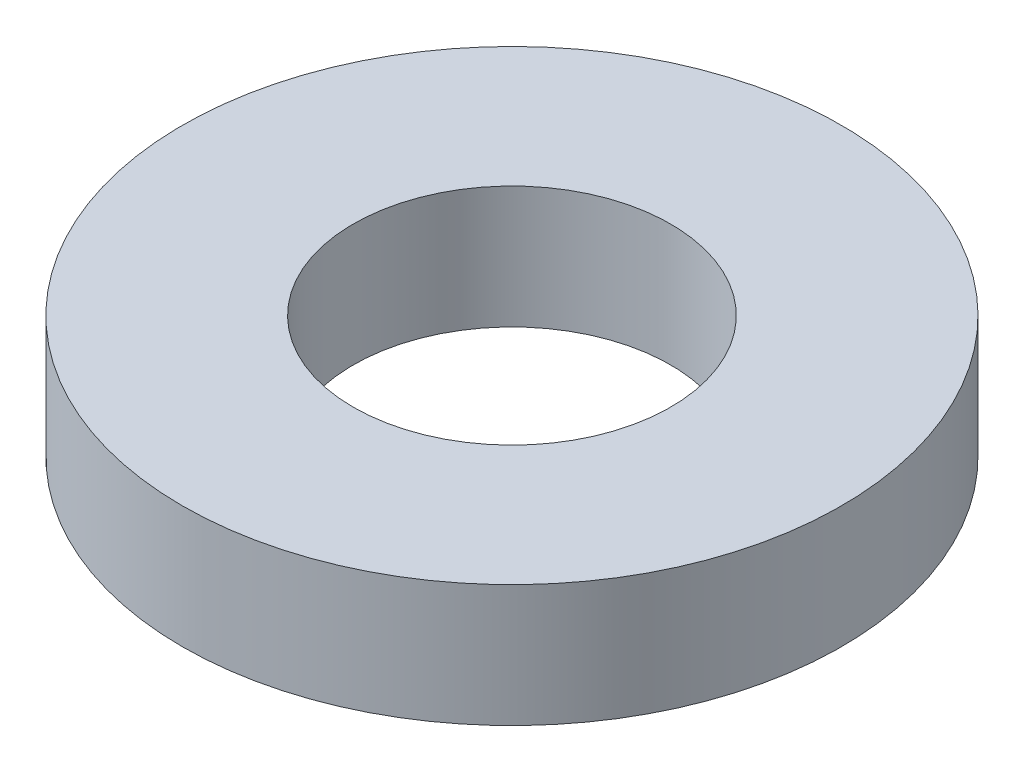
ISO-10303-21;
HEADER;
FILE_DESCRIPTION(('STEP AP214'),'2;1');
FILE_NAME('part.step','',(''),(''),'','','');
FILE_SCHEMA(('AUTOMOTIVE_DESIGN { 1 0 10303 214 1 1 1 1 }'));
ENDSEC;
DATA;
#1=APPLICATION_CONTEXT('core data for automotive mechanical design processes');
#2=APPLICATION_PROTOCOL_DEFINITION('international standard','automotive_design',2000,#1);
#3=PRODUCT_CONTEXT('',#1,'mechanical');
#4=PRODUCT('Part','Part','',(#3));
#5=PRODUCT_RELATED_PRODUCT_CATEGORY('part','',(#4));
#6=PRODUCT_DEFINITION_FORMATION('','',#4);
#7=PRODUCT_DEFINITION_CONTEXT('part definition',#1,'design');
#8=PRODUCT_DEFINITION('design','',#6,#7);
#9=PRODUCT_DEFINITION_SHAPE('','',#8);
#10=(LENGTH_UNIT() NAMED_UNIT(*) SI_UNIT(.MILLI.,.METRE.));
#11=(NAMED_UNIT(*) PLANE_ANGLE_UNIT() SI_UNIT($,.RADIAN.));
#12=(NAMED_UNIT(*) SI_UNIT($,.STERADIAN.) SOLID_ANGLE_UNIT());
#13=UNCERTAINTY_MEASURE_WITH_UNIT(LENGTH_MEASURE(1.E-05),#10,'distance_accuracy_value','');
#14=(GEOMETRIC_REPRESENTATION_CONTEXT(3) GLOBAL_UNCERTAINTY_ASSIGNED_CONTEXT((#13)) GLOBAL_UNIT_ASSIGNED_CONTEXT((#10,
#11,#12)) REPRESENTATION_CONTEXT('',''));
#15=CARTESIAN_POINT('',(0.,0.,0.));
#16=DIRECTION('',(0.,0.,1.));
#17=DIRECTION('',(1.,0.,0.));
#18=AXIS2_PLACEMENT_3D('',#15,#16,#17);
#19=CARTESIAN_POINT('',(0.,25.,0.));
#20=DIRECTION('',(0.,-1.,0.));
#21=DIRECTION('',(0.,0.,-1.));
#22=AXIS2_PLACEMENT_3D('',#19,#20,#21);
#23=CYLINDRICAL_SURFACE('',#22,67.5);
#24=CARTESIAN_POINT('',(0.,25.,0.));
#25=DIRECTION('',(0.,1.,0.));
#26=DIRECTION('',(0.,0.,1.));
#27=AXIS2_PLACEMENT_3D('',#24,#25,#26);
#28=CIRCLE('',#27,67.5);
#29=CARTESIAN_POINT('',(0.,25.,67.5));
#30=VERTEX_POINT('',#29);
#31=EDGE_CURVE('E10',#30,#30,#28,.T.);
#32=ORIENTED_EDGE('',*,*,#31,.F.);
#33=EDGE_LOOP('',(#32));
#34=FACE_BOUND('',#33,.T.);
#35=CARTESIAN_POINT('',(0.,0.,0.));
#36=DIRECTION('',(0.,1.,0.));
#37=DIRECTION('',(0.,0.,1.));
#38=AXIS2_PLACEMENT_3D('',#35,#36,#37);
#39=CIRCLE('',#38,67.5);
#40=CARTESIAN_POINT('',(0.,0.,67.5));
#41=VERTEX_POINT('',#40);
#42=EDGE_CURVE('E37',#41,#41,#39,.T.);
#43=ORIENTED_EDGE('',*,*,#42,.T.);
#44=EDGE_LOOP('',(#43));
#45=FACE_BOUND('',#44,.T.);
#46=ADVANCED_FACE('F40',(#34,#45),#23,.T.);
#47=CARTESIAN_POINT('',(0.,25.,0.));
#48=DIRECTION('',(0.,1.,0.));
#49=DIRECTION('',(0.,0.,1.));
#50=AXIS2_PLACEMENT_3D('',#47,#48,#49);
#51=PLANE('',#50);
#52=CARTESIAN_POINT('',(0.,25.,0.));
#53=DIRECTION('',(0.,1.,0.));
#54=DIRECTION('',(0.,0.,1.));
#55=AXIS2_PLACEMENT_3D('',#52,#53,#54);
#56=CIRCLE('',#55,32.5);
#57=CARTESIAN_POINT('',(0.,25.,32.5));
#58=VERTEX_POINT('',#57);
#59=EDGE_CURVE('E50',#58,#58,#56,.T.);
#60=ORIENTED_EDGE('',*,*,#59,.F.);
#61=EDGE_LOOP('',(#60));
#62=FACE_BOUND('',#61,.T.);
#63=ORIENTED_EDGE('',*,*,#31,.T.);
#64=EDGE_LOOP('',(#63));
#65=FACE_BOUND('',#64,.T.);
#66=ADVANCED_FACE('F59',(#62,#65),#51,.T.);
#67=CARTESIAN_POINT('',(0.,0.,0.));
#68=DIRECTION('',(0.,1.,0.));
#69=DIRECTION('',(0.,0.,1.));
#70=AXIS2_PLACEMENT_3D('',#67,#68,#69);
#71=PLANE('',#70);
#72=CARTESIAN_POINT('',(0.,0.,0.));
#73=DIRECTION('',(0.,1.,0.));
#74=DIRECTION('',(0.,0.,1.));
#75=AXIS2_PLACEMENT_3D('',#72,#73,#74);
#76=CIRCLE('',#75,32.5);
#77=CARTESIAN_POINT('',(0.,0.,32.5));
#78=VERTEX_POINT('',#77);
#79=EDGE_CURVE('E47',#78,#78,#76,.T.);
#80=ORIENTED_EDGE('',*,*,#79,.T.);
#81=EDGE_LOOP('',(#80));
#82=FACE_BOUND('',#81,.T.);
#83=ORIENTED_EDGE('',*,*,#42,.F.);
#84=EDGE_LOOP('',(#83));
#85=FACE_BOUND('',#84,.T.);
#86=ADVANCED_FACE('F58',(#82,#85),#71,.F.);
#87=CARTESIAN_POINT('',(0.,25.,0.));
#88=DIRECTION('',(0.,-1.,0.));
#89=DIRECTION('',(0.,0.,-1.));
#90=AXIS2_PLACEMENT_3D('',#87,#88,#89);
#91=CYLINDRICAL_SURFACE('',#90,32.5);
#92=ORIENTED_EDGE('',*,*,#59,.T.);
#93=EDGE_LOOP('',(#92));
#94=FACE_BOUND('',#93,.T.);
#95=ORIENTED_EDGE('',*,*,#79,.F.);
#96=EDGE_LOOP('',(#95));
#97=FACE_BOUND('',#96,.T.);
#98=ADVANCED_FACE('F54',(#94,#97),#91,.F.);
#99=CLOSED_SHELL('',(#46,#66,#86,#98));
#100=MANIFOLD_SOLID_BREP('B2',#99);
#101=ADVANCED_BREP_SHAPE_REPRESENTATION('',(#18,#100),#14);
#102=SHAPE_DEFINITION_REPRESENTATION(#9,#101);
ENDSEC;
END-ISO-10303-21;
